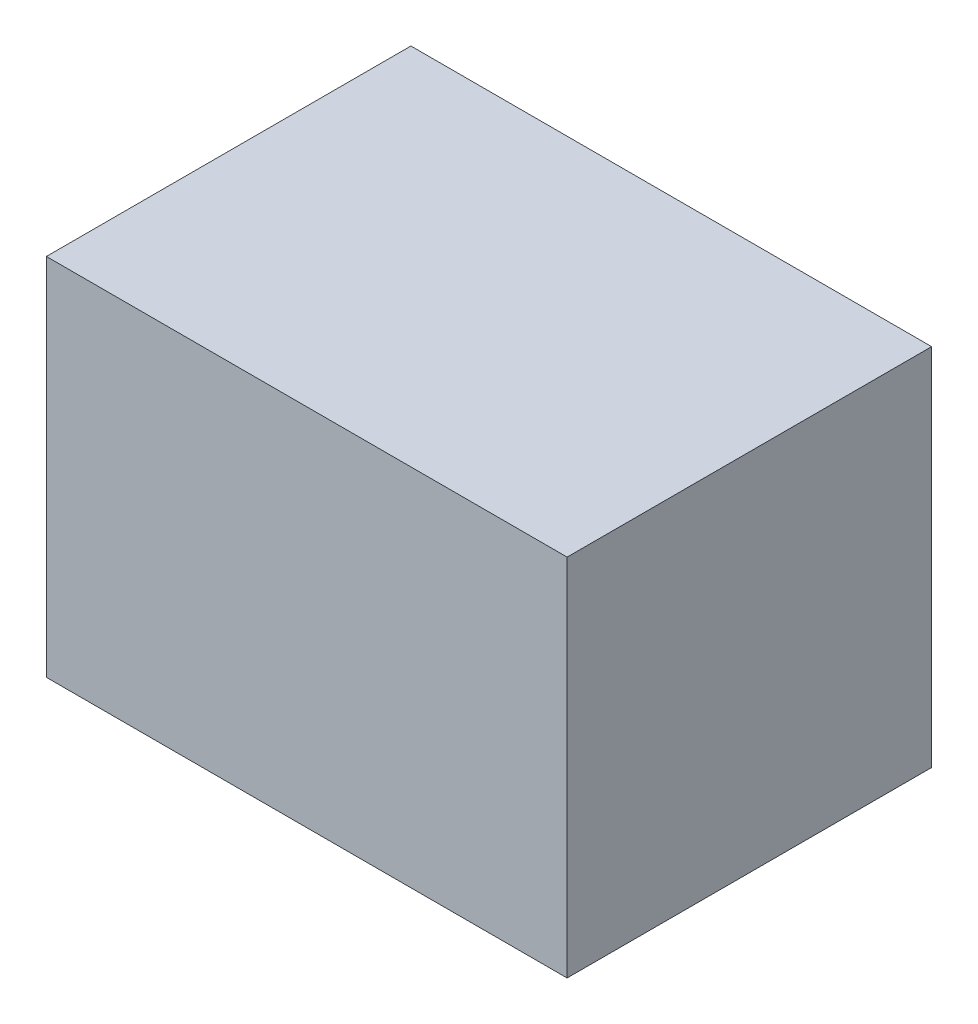
ISO-10303-21;
HEADER;
FILE_DESCRIPTION(('STEP AP214'),'2;1');
FILE_NAME('part.step','',(''),(''),'','','');
FILE_SCHEMA(('AUTOMOTIVE_DESIGN { 1 0 10303 214 1 1 1 1 }'));
ENDSEC;
DATA;
#1=APPLICATION_CONTEXT('core data for automotive mechanical design processes');
#2=APPLICATION_PROTOCOL_DEFINITION('international standard','automotive_design',2000,#1);
#3=PRODUCT_CONTEXT('',#1,'mechanical');
#4=PRODUCT('Part','Part','',(#3));
#5=PRODUCT_RELATED_PRODUCT_CATEGORY('part','',(#4));
#6=PRODUCT_DEFINITION_FORMATION('','',#4);
#7=PRODUCT_DEFINITION_CONTEXT('part definition',#1,'design');
#8=PRODUCT_DEFINITION('design','',#6,#7);
#9=PRODUCT_DEFINITION_SHAPE('','',#8);
#10=(LENGTH_UNIT() NAMED_UNIT(*) SI_UNIT(.MILLI.,.METRE.));
#11=(NAMED_UNIT(*) PLANE_ANGLE_UNIT() SI_UNIT($,.RADIAN.));
#12=(NAMED_UNIT(*) SI_UNIT($,.STERADIAN.) SOLID_ANGLE_UNIT());
#13=UNCERTAINTY_MEASURE_WITH_UNIT(LENGTH_MEASURE(1.E-05),#10,'distance_accuracy_value','');
#14=(GEOMETRIC_REPRESENTATION_CONTEXT(3) GLOBAL_UNCERTAINTY_ASSIGNED_CONTEXT((#13)) GLOBAL_UNIT_ASSIGNED_CONTEXT((#10,
#11,#12)) REPRESENTATION_CONTEXT('',''));
#15=CARTESIAN_POINT('',(0.,0.,0.));
#16=DIRECTION('',(0.,0.,1.));
#17=DIRECTION('',(1.,0.,0.));
#18=AXIS2_PLACEMENT_3D('',#15,#16,#17);
#19=CARTESIAN_POINT('',(-25.4,0.,0.));
#20=DIRECTION('',(0.,1.,0.));
#21=DIRECTION('',(1.,0.,0.));
#22=AXIS2_PLACEMENT_3D('',#19,#20,#21);
#23=PLANE('',#22);
#24=DIRECTION('',(0.,0.,1.));
#25=VECTOR('',#24,1.);
#26=CARTESIAN_POINT('',(-10.41,0.,0.749999999999982));
#27=LINE('',#26,#25);
#28=CARTESIAN_POINT('',(-10.41,0.,0.749999999999982));
#29=VERTEX_POINT('',#28);
#30=CARTESIAN_POINT('',(-10.41,0.,1.1));
#31=VERTEX_POINT('',#30);
#32=EDGE_CURVE('E83',#29,#31,#27,.T.);
#33=ORIENTED_EDGE('',*,*,#32,.T.);
#34=DIRECTION('',(1.,0.,0.));
#35=VECTOR('',#34,1.);
#36=CARTESIAN_POINT('',(-10.41,0.,1.1));
#37=LINE('',#36,#35);
#38=CARTESIAN_POINT('',(-9.91,0.,1.1));
#39=VERTEX_POINT('',#38);
#40=EDGE_CURVE('E28',#31,#39,#37,.T.);
#41=ORIENTED_EDGE('',*,*,#40,.T.);
#42=DIRECTION('',(0.,0.,1.));
#43=VECTOR('',#42,1.);
#44=CARTESIAN_POINT('',(-9.91,0.,0.749999999999982));
#45=LINE('',#44,#43);
#46=CARTESIAN_POINT('',(-9.91,0.,0.749999999999982));
#47=VERTEX_POINT('',#46);
#48=EDGE_CURVE('E101',#47,#39,#45,.T.);
#49=ORIENTED_EDGE('',*,*,#48,.F.);
#50=DIRECTION('',(1.,0.,0.));
#51=VECTOR('',#50,1.);
#52=CARTESIAN_POINT('',(-10.41,0.,0.749999999999982));
#53=LINE('',#52,#51);
#54=EDGE_CURVE('E87',#29,#47,#53,.T.);
#55=ORIENTED_EDGE('',*,*,#54,.F.);
#56=EDGE_LOOP('',(#33,#41,#49,#55));
#57=FACE_BOUND('',#56,.T.);
#58=ADVANCED_FACE('F17',(#57),#23,.T.);
#59=CARTESIAN_POINT('',(-25.4,-0.35,0.));
#60=DIRECTION('',(0.,1.,0.));
#61=DIRECTION('',(1.,0.,0.));
#62=AXIS2_PLACEMENT_3D('',#59,#60,#61);
#63=PLANE('',#62);
#64=DIRECTION('',(0.,0.,1.));
#65=VECTOR('',#64,1.);
#66=CARTESIAN_POINT('',(-10.41,-0.35,0.749999999999982));
#67=LINE('',#66,#65);
#68=CARTESIAN_POINT('',(-10.41,-0.35,0.749999999999982));
#69=VERTEX_POINT('',#68);
#70=CARTESIAN_POINT('',(-10.41,-0.35,1.1));
#71=VERTEX_POINT('',#70);
#72=EDGE_CURVE('E85',#69,#71,#67,.T.);
#73=ORIENTED_EDGE('',*,*,#72,.F.);
#74=DIRECTION('',(1.,0.,0.));
#75=VECTOR('',#74,1.);
#76=CARTESIAN_POINT('',(-10.41,-0.35,0.749999999999982));
#77=LINE('',#76,#75);
#78=CARTESIAN_POINT('',(-9.91,-0.35,0.749999999999982));
#79=VERTEX_POINT('',#78);
#80=EDGE_CURVE('E103',#69,#79,#77,.T.);
#81=ORIENTED_EDGE('',*,*,#80,.T.);
#82=DIRECTION('',(0.,0.,1.));
#83=VECTOR('',#82,1.);
#84=CARTESIAN_POINT('',(-9.91,-0.35,0.749999999999982));
#85=LINE('',#84,#83);
#86=CARTESIAN_POINT('',(-9.91,-0.35,1.1));
#87=VERTEX_POINT('',#86);
#88=EDGE_CURVE('E77',#79,#87,#85,.T.);
#89=ORIENTED_EDGE('',*,*,#88,.T.);
#90=DIRECTION('',(1.,0.,0.));
#91=VECTOR('',#90,1.);
#92=CARTESIAN_POINT('',(-10.41,-0.35,1.1));
#93=LINE('',#92,#91);
#94=EDGE_CURVE('E11',#71,#87,#93,.T.);
#95=ORIENTED_EDGE('',*,*,#94,.F.);
#96=EDGE_LOOP('',(#73,#81,#89,#95));
#97=FACE_BOUND('',#96,.T.);
#98=ADVANCED_FACE('F124',(#97),#63,.F.);
#99=CARTESIAN_POINT('',(-10.41,-0.35,1.1));
#100=DIRECTION('',(0.,0.,1.));
#101=DIRECTION('',(1.,0.,0.));
#102=AXIS2_PLACEMENT_3D('',#99,#100,#101);
#103=PLANE('',#102);
#104=ORIENTED_EDGE('',*,*,#40,.F.);
#105=DIRECTION('',(0.,1.,0.));
#106=VECTOR('',#105,1.);
#107=CARTESIAN_POINT('',(-10.41,-0.35,1.1));
#108=LINE('',#107,#106);
#109=EDGE_CURVE('E68',#71,#31,#108,.T.);
#110=ORIENTED_EDGE('',*,*,#109,.F.);
#111=ORIENTED_EDGE('',*,*,#94,.T.);
#112=DIRECTION('',(0.,1.,0.));
#113=VECTOR('',#112,1.);
#114=CARTESIAN_POINT('',(-9.91,-0.35,1.1));
#115=LINE('',#114,#113);
#116=EDGE_CURVE('E71',#87,#39,#115,.T.);
#117=ORIENTED_EDGE('',*,*,#116,.T.);
#118=EDGE_LOOP('',(#104,#110,#111,#117));
#119=FACE_BOUND('',#118,.T.);
#120=ADVANCED_FACE('F67',(#119),#103,.T.);
#121=CARTESIAN_POINT('',(-9.91,-0.35,0.749999999999982));
#122=DIRECTION('',(-1.,0.,0.));
#123=DIRECTION('',(0.,0.,1.));
#124=AXIS2_PLACEMENT_3D('',#121,#122,#123);
#125=PLANE('',#124);
#126=ORIENTED_EDGE('',*,*,#48,.T.);
#127=ORIENTED_EDGE('',*,*,#116,.F.);
#128=ORIENTED_EDGE('',*,*,#88,.F.);
#129=DIRECTION('',(0.,1.,0.));
#130=VECTOR('',#129,1.);
#131=CARTESIAN_POINT('',(-9.91,-0.35,0.749999999999982));
#132=LINE('',#131,#130);
#133=EDGE_CURVE('E108',#79,#47,#132,.T.);
#134=ORIENTED_EDGE('',*,*,#133,.T.);
#135=EDGE_LOOP('',(#126,#127,#128,#134));
#136=FACE_BOUND('',#135,.T.);
#137=ADVANCED_FACE('F122',(#136),#125,.F.);
#138=CARTESIAN_POINT('',(-10.41,-0.35,0.749999999999982));
#139=DIRECTION('',(0.,0.,1.));
#140=DIRECTION('',(1.,0.,0.));
#141=AXIS2_PLACEMENT_3D('',#138,#139,#140);
#142=PLANE('',#141);
#143=ORIENTED_EDGE('',*,*,#54,.T.);
#144=ORIENTED_EDGE('',*,*,#133,.F.);
#145=ORIENTED_EDGE('',*,*,#80,.F.);
#146=DIRECTION('',(0.,1.,0.));
#147=VECTOR('',#146,1.);
#148=CARTESIAN_POINT('',(-10.41,-0.35,0.749999999999982));
#149=LINE('',#148,#147);
#150=EDGE_CURVE('E21',#69,#29,#149,.T.);
#151=ORIENTED_EDGE('',*,*,#150,.T.);
#152=EDGE_LOOP('',(#143,#144,#145,#151));
#153=FACE_BOUND('',#152,.T.);
#154=ADVANCED_FACE('F19',(#153),#142,.F.);
#155=CARTESIAN_POINT('',(-10.41,-0.35,0.749999999999982));
#156=DIRECTION('',(-1.,0.,0.));
#157=DIRECTION('',(0.,0.,1.));
#158=AXIS2_PLACEMENT_3D('',#155,#156,#157);
#159=PLANE('',#158);
#160=ORIENTED_EDGE('',*,*,#32,.F.);
#161=ORIENTED_EDGE('',*,*,#150,.F.);
#162=ORIENTED_EDGE('',*,*,#72,.T.);
#163=ORIENTED_EDGE('',*,*,#109,.T.);
#164=EDGE_LOOP('',(#160,#161,#162,#163));
#165=FACE_BOUND('',#164,.T.);
#166=ADVANCED_FACE('F81',(#165),#159,.T.);
#167=CLOSED_SHELL('',(#58,#98,#120,#137,#154,#166));
#168=MANIFOLD_SOLID_BREP('B1',#167);
#169=ADVANCED_BREP_SHAPE_REPRESENTATION('',(#18,#168),#14);
#170=SHAPE_DEFINITION_REPRESENTATION(#9,#169);
ENDSEC;
END-ISO-10303-21;
